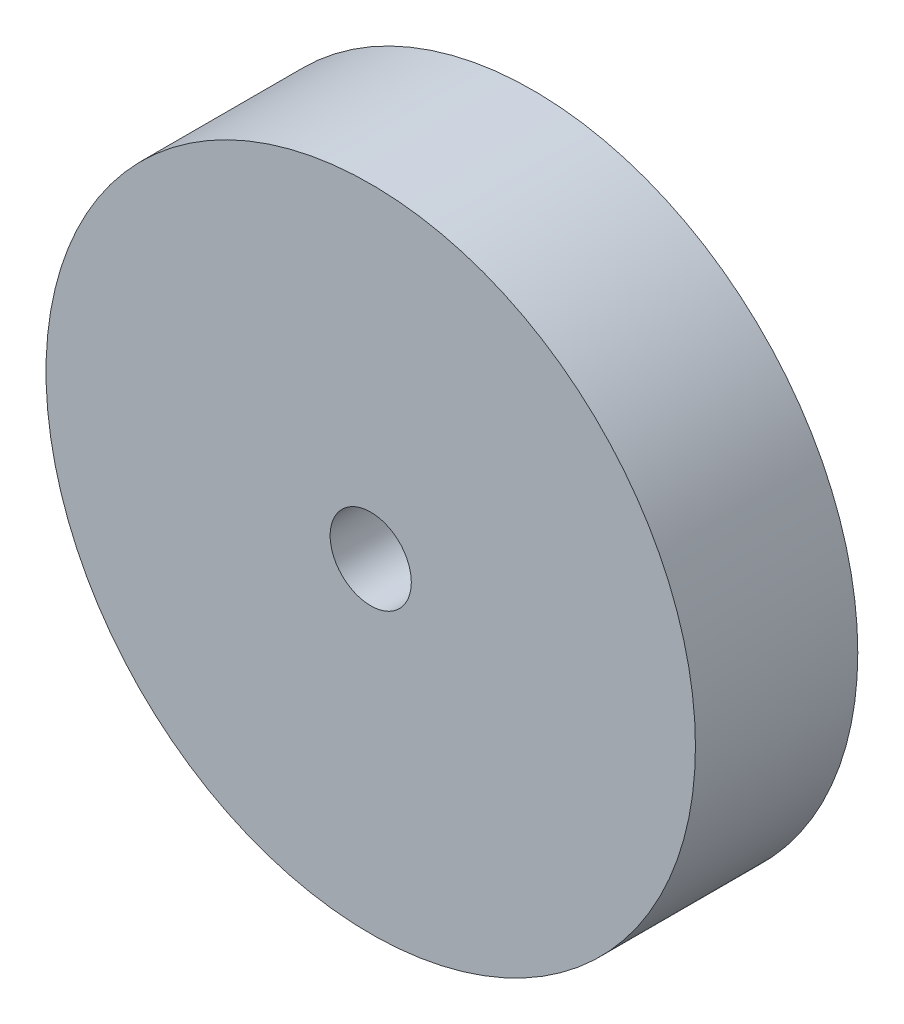
ISO-10303-21;
HEADER;
FILE_DESCRIPTION(('STEP AP214'),'2;1');
FILE_NAME('part.step','',(''),(''),'','','');
FILE_SCHEMA(('AUTOMOTIVE_DESIGN { 1 0 10303 214 1 1 1 1 }'));
ENDSEC;
DATA;
#1=APPLICATION_CONTEXT('core data for automotive mechanical design processes');
#2=APPLICATION_PROTOCOL_DEFINITION('international standard','automotive_design',2000,#1);
#3=PRODUCT_CONTEXT('',#1,'mechanical');
#4=PRODUCT('Part','Part','',(#3));
#5=PRODUCT_RELATED_PRODUCT_CATEGORY('part','',(#4));
#6=PRODUCT_DEFINITION_FORMATION('','',#4);
#7=PRODUCT_DEFINITION_CONTEXT('part definition',#1,'design');
#8=PRODUCT_DEFINITION('design','',#6,#7);
#9=PRODUCT_DEFINITION_SHAPE('','',#8);
#10=(LENGTH_UNIT() NAMED_UNIT(*) SI_UNIT(.MILLI.,.METRE.));
#11=(NAMED_UNIT(*) PLANE_ANGLE_UNIT() SI_UNIT($,.RADIAN.));
#12=(NAMED_UNIT(*) SI_UNIT($,.STERADIAN.) SOLID_ANGLE_UNIT());
#13=UNCERTAINTY_MEASURE_WITH_UNIT(LENGTH_MEASURE(1.E-05),#10,'distance_accuracy_value','');
#14=(GEOMETRIC_REPRESENTATION_CONTEXT(3) GLOBAL_UNCERTAINTY_ASSIGNED_CONTEXT((#13)) GLOBAL_UNIT_ASSIGNED_CONTEXT((#10,
#11,#12)) REPRESENTATION_CONTEXT('',''));
#15=CARTESIAN_POINT('',(0.,0.,0.));
#16=DIRECTION('',(0.,0.,1.));
#17=DIRECTION('',(1.,0.,0.));
#18=AXIS2_PLACEMENT_3D('',#15,#16,#17);
#19=CARTESIAN_POINT('',(0.,0.,5.));
#20=DIRECTION('',(0.,0.,1.));
#21=DIRECTION('',(1.,0.,0.));
#22=AXIS2_PLACEMENT_3D('',#19,#20,#21);
#23=PLANE('',#22);
#24=CARTESIAN_POINT('',(0.,0.,5.));
#25=DIRECTION('',(0.,0.,1.));
#26=DIRECTION('',(1.,0.,0.));
#27=AXIS2_PLACEMENT_3D('',#24,#25,#26);
#28=CIRCLE('',#27,10.);
#29=CARTESIAN_POINT('',(10.,0.,5.));
#30=VERTEX_POINT('',#29);
#31=EDGE_CURVE('E10',#30,#30,#28,.T.);
#32=ORIENTED_EDGE('',*,*,#31,.T.);
#33=EDGE_LOOP('',(#32));
#34=FACE_BOUND('',#33,.T.);
#35=CARTESIAN_POINT('',(0.,0.,5.));
#36=DIRECTION('',(0.,0.,1.));
#37=DIRECTION('',(1.,0.,0.));
#38=AXIS2_PLACEMENT_3D('',#35,#36,#37);
#39=CIRCLE('',#38,1.25);
#40=CARTESIAN_POINT('',(1.25,0.,5.));
#41=VERTEX_POINT('',#40);
#42=EDGE_CURVE('E42',#41,#41,#39,.T.);
#43=ORIENTED_EDGE('',*,*,#42,.F.);
#44=EDGE_LOOP('',(#43));
#45=FACE_BOUND('',#44,.T.);
#46=ADVANCED_FACE('F31',(#34,#45),#23,.T.);
#47=CARTESIAN_POINT('',(0.,0.,0.));
#48=DIRECTION('',(0.,0.,1.));
#49=DIRECTION('',(1.,0.,0.));
#50=AXIS2_PLACEMENT_3D('',#47,#48,#49);
#51=PLANE('',#50);
#52=CARTESIAN_POINT('',(0.,0.,0.));
#53=DIRECTION('',(0.,0.,1.));
#54=DIRECTION('',(1.,0.,0.));
#55=AXIS2_PLACEMENT_3D('',#52,#53,#54);
#56=CIRCLE('',#55,10.);
#57=CARTESIAN_POINT('',(10.,0.,0.));
#58=VERTEX_POINT('',#57);
#59=EDGE_CURVE('E35',#58,#58,#56,.T.);
#60=ORIENTED_EDGE('',*,*,#59,.F.);
#61=EDGE_LOOP('',(#60));
#62=FACE_BOUND('',#61,.T.);
#63=CARTESIAN_POINT('',(0.,0.,0.));
#64=DIRECTION('',(0.,0.,1.));
#65=DIRECTION('',(1.,0.,0.));
#66=AXIS2_PLACEMENT_3D('',#63,#64,#65);
#67=CIRCLE('',#66,1.25);
#68=CARTESIAN_POINT('',(1.25,0.,0.));
#69=VERTEX_POINT('',#68);
#70=EDGE_CURVE('E44',#69,#69,#67,.T.);
#71=ORIENTED_EDGE('',*,*,#70,.T.);
#72=EDGE_LOOP('',(#71));
#73=FACE_BOUND('',#72,.T.);
#74=ADVANCED_FACE('F54',(#62,#73),#51,.F.);
#75=CARTESIAN_POINT('',(0.,0.,5.));
#76=DIRECTION('',(0.,0.,-1.));
#77=DIRECTION('',(-1.,0.,0.));
#78=AXIS2_PLACEMENT_3D('',#75,#76,#77);
#79=CYLINDRICAL_SURFACE('',#78,10.);
#80=ORIENTED_EDGE('',*,*,#31,.F.);
#81=EDGE_LOOP('',(#80));
#82=FACE_BOUND('',#81,.T.);
#83=ORIENTED_EDGE('',*,*,#59,.T.);
#84=EDGE_LOOP('',(#83));
#85=FACE_BOUND('',#84,.T.);
#86=ADVANCED_FACE('F33',(#82,#85),#79,.T.);
#87=CARTESIAN_POINT('',(0.,0.,5.));
#88=DIRECTION('',(0.,0.,-1.));
#89=DIRECTION('',(-1.,0.,0.));
#90=AXIS2_PLACEMENT_3D('',#87,#88,#89);
#91=CYLINDRICAL_SURFACE('',#90,1.25);
#92=ORIENTED_EDGE('',*,*,#42,.T.);
#93=EDGE_LOOP('',(#92));
#94=FACE_BOUND('',#93,.T.);
#95=ORIENTED_EDGE('',*,*,#70,.F.);
#96=EDGE_LOOP('',(#95));
#97=FACE_BOUND('',#96,.T.);
#98=ADVANCED_FACE('F50',(#94,#97),#91,.F.);
#99=CLOSED_SHELL('',(#46,#74,#86,#98));
#100=MANIFOLD_SOLID_BREP('B2',#99);
#101=ADVANCED_BREP_SHAPE_REPRESENTATION('',(#18,#100),#14);
#102=SHAPE_DEFINITION_REPRESENTATION(#9,#101);
ENDSEC;
END-ISO-10303-21;
